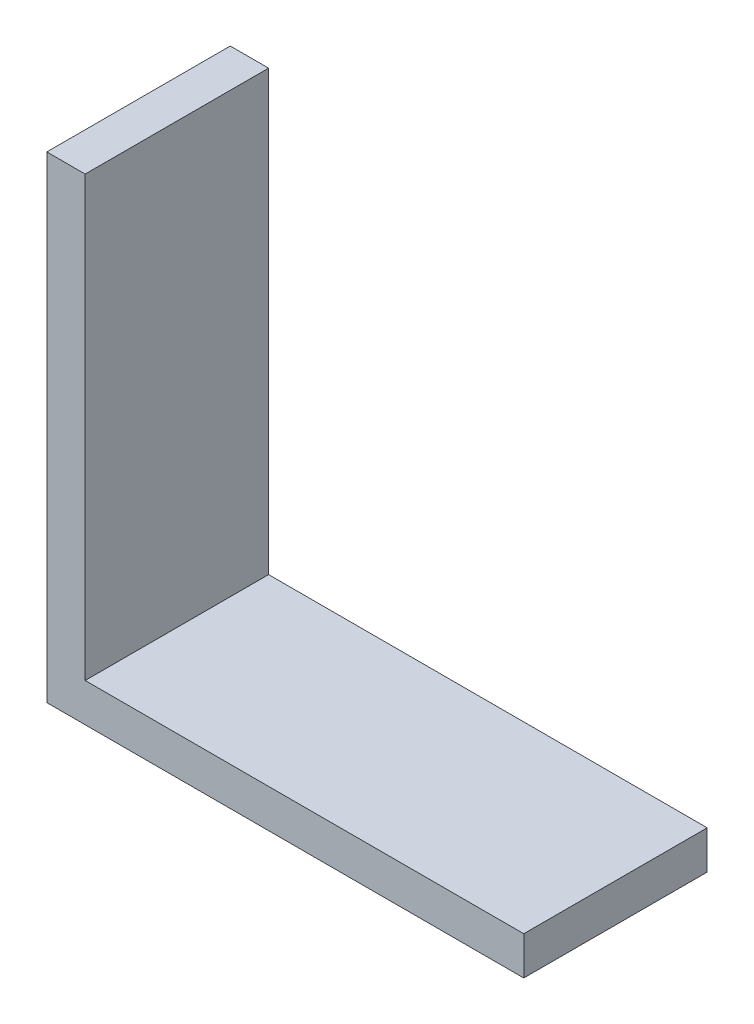
ISO-10303-21;
HEADER;
FILE_DESCRIPTION(('STEP AP214'),'2;1');
FILE_NAME('part.step','',(''),(''),'','','');
FILE_SCHEMA(('AUTOMOTIVE_DESIGN { 1 0 10303 214 1 1 1 1 }'));
ENDSEC;
DATA;
#1=APPLICATION_CONTEXT('core data for automotive mechanical design processes');
#2=APPLICATION_PROTOCOL_DEFINITION('international standard','automotive_design',2000,#1);
#3=PRODUCT_CONTEXT('',#1,'mechanical');
#4=PRODUCT('Part','Part','',(#3));
#5=PRODUCT_RELATED_PRODUCT_CATEGORY('part','',(#4));
#6=PRODUCT_DEFINITION_FORMATION('','',#4);
#7=PRODUCT_DEFINITION_CONTEXT('part definition',#1,'design');
#8=PRODUCT_DEFINITION('design','',#6,#7);
#9=PRODUCT_DEFINITION_SHAPE('','',#8);
#10=(LENGTH_UNIT() NAMED_UNIT(*) SI_UNIT(.MILLI.,.METRE.));
#11=(NAMED_UNIT(*) PLANE_ANGLE_UNIT() SI_UNIT($,.RADIAN.));
#12=(NAMED_UNIT(*) SI_UNIT($,.STERADIAN.) SOLID_ANGLE_UNIT());
#13=UNCERTAINTY_MEASURE_WITH_UNIT(LENGTH_MEASURE(1.E-05),#10,'distance_accuracy_value','');
#14=(GEOMETRIC_REPRESENTATION_CONTEXT(3) GLOBAL_UNCERTAINTY_ASSIGNED_CONTEXT((#13)) GLOBAL_UNIT_ASSIGNED_CONTEXT((#10,
#11,#12)) REPRESENTATION_CONTEXT('',''));
#15=CARTESIAN_POINT('',(0.,0.,0.));
#16=DIRECTION('',(0.,0.,1.));
#17=DIRECTION('',(1.,0.,0.));
#18=AXIS2_PLACEMENT_3D('',#15,#16,#17);
#19=CARTESIAN_POINT('',(-15.478125,2.4892,-5.953125));
#20=DIRECTION('',(0.,1.,0.));
#21=DIRECTION('',(0.,0.,1.));
#22=AXIS2_PLACEMENT_3D('',#19,#20,#21);
#23=PLANE('',#22);
#24=DIRECTION('',(-1.,0.,0.));
#25=VECTOR('',#24,1.);
#26=CARTESIAN_POINT('',(15.478125,2.4892,-5.953125));
#27=LINE('',#26,#25);
#28=CARTESIAN_POINT('',(15.478125,2.4892,-5.953125));
#29=VERTEX_POINT('',#28);
#30=CARTESIAN_POINT('',(-12.988925,2.4892,-5.953125));
#31=VERTEX_POINT('',#30);
#32=EDGE_CURVE('E48',#29,#31,#27,.T.);
#33=ORIENTED_EDGE('',*,*,#32,.T.);
#34=DIRECTION('',(0.,0.,1.));
#35=VECTOR('',#34,1.);
#36=CARTESIAN_POINT('',(-12.988925,2.4892,-5.953125));
#37=LINE('',#36,#35);
#38=CARTESIAN_POINT('',(-12.988925,2.4892,5.953125));
#39=VERTEX_POINT('',#38);
#40=EDGE_CURVE('E52',#31,#39,#37,.T.);
#41=ORIENTED_EDGE('',*,*,#40,.T.);
#42=DIRECTION('',(1.,0.,0.));
#43=VECTOR('',#42,1.);
#44=CARTESIAN_POINT('',(15.478125,2.4892,5.953125));
#45=LINE('',#44,#43);
#46=CARTESIAN_POINT('',(15.478125,2.4892,5.953125));
#47=VERTEX_POINT('',#46);
#48=EDGE_CURVE('E113',#39,#47,#45,.T.);
#49=ORIENTED_EDGE('',*,*,#48,.T.);
#50=DIRECTION('',(0.,0.,-1.));
#51=VECTOR('',#50,1.);
#52=CARTESIAN_POINT('',(15.478125,2.4892,5.953125));
#53=LINE('',#52,#51);
#54=EDGE_CURVE('E115',#47,#29,#53,.T.);
#55=ORIENTED_EDGE('',*,*,#54,.T.);
#56=EDGE_LOOP('',(#33,#41,#49,#55));
#57=FACE_BOUND('',#56,.T.);
#58=ADVANCED_FACE('F33',(#57),#23,.T.);
#59=CARTESIAN_POINT('',(-15.478125,2.4892,5.953125));
#60=DIRECTION('',(1.,0.,0.));
#61=DIRECTION('',(0.,0.,-1.));
#62=AXIS2_PLACEMENT_3D('',#59,#60,#61);
#63=PLANE('',#62);
#64=DIRECTION('',(0.,0.,1.));
#65=VECTOR('',#64,1.);
#66=CARTESIAN_POINT('',(-15.478125,0.,5.953125));
#67=LINE('',#66,#65);
#68=CARTESIAN_POINT('',(-15.478125,0.,-5.953125));
#69=VERTEX_POINT('',#68);
#70=CARTESIAN_POINT('',(-15.478125,0.,5.953125));
#71=VERTEX_POINT('',#70);
#72=EDGE_CURVE('E89',#69,#71,#67,.T.);
#73=ORIENTED_EDGE('',*,*,#72,.T.);
#74=DIRECTION('',(0.,-1.,0.));
#75=VECTOR('',#74,1.);
#76=CARTESIAN_POINT('',(-15.478125,2.4892,5.953125));
#77=LINE('',#76,#75);
#78=CARTESIAN_POINT('',(-15.478125,30.95625,5.953125));
#79=VERTEX_POINT('',#78);
#80=EDGE_CURVE('E11',#79,#71,#77,.T.);
#81=ORIENTED_EDGE('',*,*,#80,.F.);
#82=DIRECTION('',(0.,0.,1.));
#83=VECTOR('',#82,1.);
#84=CARTESIAN_POINT('',(-15.478125,30.95625,-5.953125));
#85=LINE('',#84,#83);
#86=CARTESIAN_POINT('',(-15.478125,30.95625,-5.953125));
#87=VERTEX_POINT('',#86);
#88=EDGE_CURVE('E87',#87,#79,#85,.T.);
#89=ORIENTED_EDGE('',*,*,#88,.F.);
#90=DIRECTION('',(0.,-1.,0.));
#91=VECTOR('',#90,1.);
#92=CARTESIAN_POINT('',(-15.478125,2.4892,-5.953125));
#93=LINE('',#92,#91);
#94=EDGE_CURVE('E119',#87,#69,#93,.T.);
#95=ORIENTED_EDGE('',*,*,#94,.T.);
#96=EDGE_LOOP('',(#73,#81,#89,#95));
#97=FACE_BOUND('',#96,.T.);
#98=ADVANCED_FACE('F35',(#97),#63,.F.);
#99=CARTESIAN_POINT('',(15.478125,2.4892,5.953125));
#100=DIRECTION('',(0.,0.,-1.));
#101=DIRECTION('',(-1.,0.,0.));
#102=AXIS2_PLACEMENT_3D('',#99,#100,#101);
#103=PLANE('',#102);
#104=DIRECTION('',(1.,0.,0.));
#105=VECTOR('',#104,1.);
#106=CARTESIAN_POINT('',(15.478125,0.,5.953125));
#107=LINE('',#106,#105);
#108=CARTESIAN_POINT('',(15.478125,0.,5.953125));
#109=VERTEX_POINT('',#108);
#110=EDGE_CURVE('E121',#71,#109,#107,.T.);
#111=ORIENTED_EDGE('',*,*,#110,.T.);
#112=DIRECTION('',(0.,-1.,0.));
#113=VECTOR('',#112,1.);
#114=CARTESIAN_POINT('',(15.478125,2.4892,5.953125));
#115=LINE('',#114,#113);
#116=EDGE_CURVE('E41',#47,#109,#115,.T.);
#117=ORIENTED_EDGE('',*,*,#116,.F.);
#118=ORIENTED_EDGE('',*,*,#48,.F.);
#119=DIRECTION('',(0.,-1.,0.));
#120=VECTOR('',#119,1.);
#121=CARTESIAN_POINT('',(-12.988925,30.95625,5.953125));
#122=LINE('',#121,#120);
#123=CARTESIAN_POINT('',(-12.988925,30.95625,5.953125));
#124=VERTEX_POINT('',#123);
#125=EDGE_CURVE('E95',#124,#39,#122,.T.);
#126=ORIENTED_EDGE('',*,*,#125,.F.);
#127=DIRECTION('',(1.,0.,0.));
#128=VECTOR('',#127,1.);
#129=CARTESIAN_POINT('',(-12.988925,30.95625,5.953125));
#130=LINE('',#129,#128);
#131=EDGE_CURVE('E92',#79,#124,#130,.T.);
#132=ORIENTED_EDGE('',*,*,#131,.F.);
#133=ORIENTED_EDGE('',*,*,#80,.T.);
#134=EDGE_LOOP('',(#111,#117,#118,#126,#132,#133));
#135=FACE_BOUND('',#134,.T.);
#136=ADVANCED_FACE('F93',(#135),#103,.F.);
#137=CARTESIAN_POINT('',(15.478125,2.4892,5.953125));
#138=DIRECTION('',(-1.,0.,0.));
#139=DIRECTION('',(0.,0.,1.));
#140=AXIS2_PLACEMENT_3D('',#137,#138,#139);
#141=PLANE('',#140);
#142=DIRECTION('',(0.,0.,-1.));
#143=VECTOR('',#142,1.);
#144=CARTESIAN_POINT('',(15.478125,0.,5.953125));
#145=LINE('',#144,#143);
#146=CARTESIAN_POINT('',(15.478125,0.,-5.953125));
#147=VERTEX_POINT('',#146);
#148=EDGE_CURVE('E123',#109,#147,#145,.T.);
#149=ORIENTED_EDGE('',*,*,#148,.T.);
#150=DIRECTION('',(0.,-1.,0.));
#151=VECTOR('',#150,1.);
#152=CARTESIAN_POINT('',(15.478125,2.4892,-5.953125));
#153=LINE('',#152,#151);
#154=EDGE_CURVE('E127',#29,#147,#153,.T.);
#155=ORIENTED_EDGE('',*,*,#154,.F.);
#156=ORIENTED_EDGE('',*,*,#54,.F.);
#157=ORIENTED_EDGE('',*,*,#116,.T.);
#158=EDGE_LOOP('',(#149,#155,#156,#157));
#159=FACE_BOUND('',#158,.T.);
#160=ADVANCED_FACE('F134',(#159),#141,.F.);
#161=CARTESIAN_POINT('',(15.478125,2.4892,-5.953125));
#162=DIRECTION('',(0.,0.,1.));
#163=DIRECTION('',(1.,0.,0.));
#164=AXIS2_PLACEMENT_3D('',#161,#162,#163);
#165=PLANE('',#164);
#166=ORIENTED_EDGE('',*,*,#94,.F.);
#167=DIRECTION('',(-1.,0.,0.));
#168=VECTOR('',#167,1.);
#169=CARTESIAN_POINT('',(-15.478125,30.95625,-5.953125));
#170=LINE('',#169,#168);
#171=CARTESIAN_POINT('',(-12.988925,30.95625,-5.953125));
#172=VERTEX_POINT('',#171);
#173=EDGE_CURVE('E103',#172,#87,#170,.T.);
#174=ORIENTED_EDGE('',*,*,#173,.F.);
#175=DIRECTION('',(0.,-1.,0.));
#176=VECTOR('',#175,1.);
#177=CARTESIAN_POINT('',(-12.988925,30.95625,-5.953125));
#178=LINE('',#177,#176);
#179=EDGE_CURVE('E108',#172,#31,#178,.T.);
#180=ORIENTED_EDGE('',*,*,#179,.T.);
#181=ORIENTED_EDGE('',*,*,#32,.F.);
#182=ORIENTED_EDGE('',*,*,#154,.T.);
#183=DIRECTION('',(-1.,0.,0.));
#184=VECTOR('',#183,1.);
#185=CARTESIAN_POINT('',(15.478125,0.,-5.953125));
#186=LINE('',#185,#184);
#187=EDGE_CURVE('E116',#147,#69,#186,.T.);
#188=ORIENTED_EDGE('',*,*,#187,.T.);
#189=EDGE_LOOP('',(#166,#174,#180,#181,#182,#188));
#190=FACE_BOUND('',#189,.T.);
#191=ADVANCED_FACE('F140',(#190),#165,.F.);
#192=CARTESIAN_POINT('',(-15.478125,0.,-5.953125));
#193=DIRECTION('',(0.,1.,0.));
#194=DIRECTION('',(0.,0.,1.));
#195=AXIS2_PLACEMENT_3D('',#192,#193,#194);
#196=PLANE('',#195);
#197=ORIENTED_EDGE('',*,*,#72,.F.);
#198=ORIENTED_EDGE('',*,*,#187,.F.);
#199=ORIENTED_EDGE('',*,*,#148,.F.);
#200=ORIENTED_EDGE('',*,*,#110,.F.);
#201=EDGE_LOOP('',(#197,#198,#199,#200));
#202=FACE_BOUND('',#201,.T.);
#203=ADVANCED_FACE('F138',(#202),#196,.F.);
#204=CARTESIAN_POINT('',(-12.988925,30.95625,-5.953125));
#205=DIRECTION('',(-1.,0.,0.));
#206=DIRECTION('',(0.,0.,1.));
#207=AXIS2_PLACEMENT_3D('',#204,#205,#206);
#208=PLANE('',#207);
#209=ORIENTED_EDGE('',*,*,#40,.F.);
#210=ORIENTED_EDGE('',*,*,#179,.F.);
#211=DIRECTION('',(0.,0.,-1.));
#212=VECTOR('',#211,1.);
#213=CARTESIAN_POINT('',(-12.988925,30.95625,-5.953125));
#214=LINE('',#213,#212);
#215=EDGE_CURVE('E98',#124,#172,#214,.T.);
#216=ORIENTED_EDGE('',*,*,#215,.F.);
#217=ORIENTED_EDGE('',*,*,#125,.T.);
#218=EDGE_LOOP('',(#209,#210,#216,#217));
#219=FACE_BOUND('',#218,.T.);
#220=ADVANCED_FACE('F143',(#219),#208,.F.);
#221=CARTESIAN_POINT('',(-15.478125,30.95625,5.953125));
#222=DIRECTION('',(0.,-1.,0.));
#223=DIRECTION('',(0.,0.,-1.));
#224=AXIS2_PLACEMENT_3D('',#221,#222,#223);
#225=PLANE('',#224);
#226=ORIENTED_EDGE('',*,*,#88,.T.);
#227=ORIENTED_EDGE('',*,*,#131,.T.);
#228=ORIENTED_EDGE('',*,*,#215,.T.);
#229=ORIENTED_EDGE('',*,*,#173,.T.);
#230=EDGE_LOOP('',(#226,#227,#228,#229));
#231=FACE_BOUND('',#230,.T.);
#232=ADVANCED_FACE('F101',(#231),#225,.F.);
#233=CLOSED_SHELL('',(#58,#98,#136,#160,#191,#203,#220,#232));
#234=MANIFOLD_SOLID_BREP('B2',#233);
#235=ADVANCED_BREP_SHAPE_REPRESENTATION('',(#18,#234),#14);
#236=SHAPE_DEFINITION_REPRESENTATION(#9,#235);
ENDSEC;
END-ISO-10303-21;
